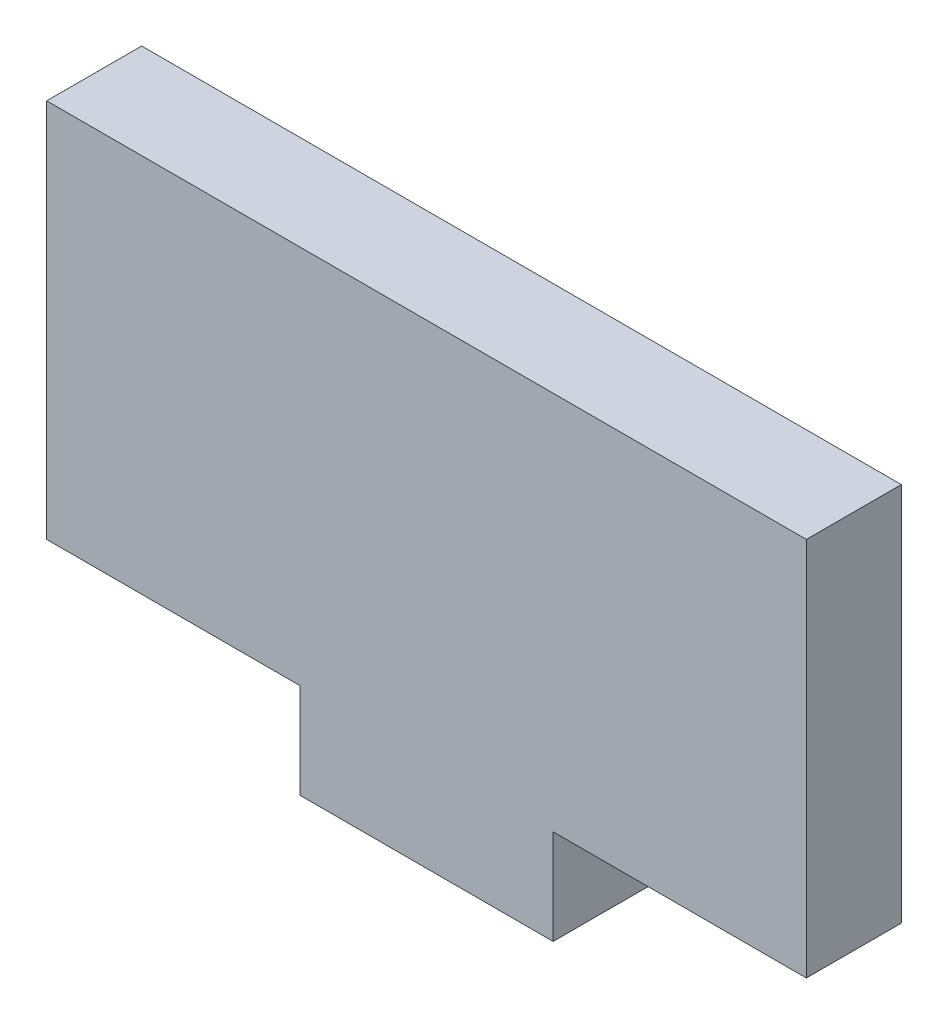
ISO-10303-21;
HEADER;
FILE_DESCRIPTION(('STEP AP214'),'2;1');
FILE_NAME('part.step','',(''),(''),'','','');
FILE_SCHEMA(('AUTOMOTIVE_DESIGN { 1 0 10303 214 1 1 1 1 }'));
ENDSEC;
DATA;
#1=APPLICATION_CONTEXT('core data for automotive mechanical design processes');
#2=APPLICATION_PROTOCOL_DEFINITION('international standard','automotive_design',2000,#1);
#3=PRODUCT_CONTEXT('',#1,'mechanical');
#4=PRODUCT('Part','Part','',(#3));
#5=PRODUCT_RELATED_PRODUCT_CATEGORY('part','',(#4));
#6=PRODUCT_DEFINITION_FORMATION('','',#4);
#7=PRODUCT_DEFINITION_CONTEXT('part definition',#1,'design');
#8=PRODUCT_DEFINITION('design','',#6,#7);
#9=PRODUCT_DEFINITION_SHAPE('','',#8);
#10=(LENGTH_UNIT() NAMED_UNIT(*) SI_UNIT(.MILLI.,.METRE.));
#11=(NAMED_UNIT(*) PLANE_ANGLE_UNIT() SI_UNIT($,.RADIAN.));
#12=(NAMED_UNIT(*) SI_UNIT($,.STERADIAN.) SOLID_ANGLE_UNIT());
#13=UNCERTAINTY_MEASURE_WITH_UNIT(LENGTH_MEASURE(1.E-05),#10,'distance_accuracy_value','');
#14=(GEOMETRIC_REPRESENTATION_CONTEXT(3) GLOBAL_UNCERTAINTY_ASSIGNED_CONTEXT((#13)) GLOBAL_UNIT_ASSIGNED_CONTEXT((#10,
#11,#12)) REPRESENTATION_CONTEXT('',''));
#15=CARTESIAN_POINT('',(0.,0.,0.));
#16=DIRECTION('',(0.,0.,1.));
#17=DIRECTION('',(1.,0.,0.));
#18=AXIS2_PLACEMENT_3D('',#15,#16,#17);
#19=CARTESIAN_POINT('',(0.,0.,6.35));
#20=DIRECTION('',(1.,0.,0.));
#21=DIRECTION('',(0.,0.,-1.));
#22=AXIS2_PLACEMENT_3D('',#19,#20,#21);
#23=PLANE('',#22);
#24=DIRECTION('',(0.,-1.,0.));
#25=VECTOR('',#24,1.);
#26=CARTESIAN_POINT('',(0.,0.,0.));
#27=LINE('',#26,#25);
#28=CARTESIAN_POINT('',(0.,25.4,0.));
#29=VERTEX_POINT('',#28);
#30=CARTESIAN_POINT('',(0.,0.,0.));
#31=VERTEX_POINT('',#30);
#32=EDGE_CURVE('E128',#29,#31,#27,.T.);
#33=ORIENTED_EDGE('',*,*,#32,.T.);
#34=DIRECTION('',(0.,0.,-1.));
#35=VECTOR('',#34,1.);
#36=CARTESIAN_POINT('',(0.,0.,6.35));
#37=LINE('',#36,#35);
#38=CARTESIAN_POINT('',(0.,0.,6.35));
#39=VERTEX_POINT('',#38);
#40=EDGE_CURVE('E11',#39,#31,#37,.T.);
#41=ORIENTED_EDGE('',*,*,#40,.F.);
#42=DIRECTION('',(0.,-1.,0.));
#43=VECTOR('',#42,1.);
#44=CARTESIAN_POINT('',(0.,0.,6.35));
#45=LINE('',#44,#43);
#46=CARTESIAN_POINT('',(0.,25.4,6.35));
#47=VERTEX_POINT('',#46);
#48=EDGE_CURVE('E142',#47,#39,#45,.T.);
#49=ORIENTED_EDGE('',*,*,#48,.F.);
#50=DIRECTION('',(0.,0.,-1.));
#51=VECTOR('',#50,1.);
#52=CARTESIAN_POINT('',(0.,25.4,6.35));
#53=LINE('',#52,#51);
#54=EDGE_CURVE('E124',#47,#29,#53,.T.);
#55=ORIENTED_EDGE('',*,*,#54,.T.);
#56=EDGE_LOOP('',(#33,#41,#49,#55));
#57=FACE_BOUND('',#56,.T.);
#58=ADVANCED_FACE('F32',(#57),#23,.F.);
#59=CARTESIAN_POINT('',(0.,0.,6.35));
#60=DIRECTION('',(0.,1.,0.));
#61=DIRECTION('',(0.,0.,1.));
#62=AXIS2_PLACEMENT_3D('',#59,#60,#61);
#63=PLANE('',#62);
#64=DIRECTION('',(1.,0.,0.));
#65=VECTOR('',#64,1.);
#66=CARTESIAN_POINT('',(0.,0.,0.));
#67=LINE('',#66,#65);
#68=CARTESIAN_POINT('',(16.9333333333333,0.,0.));
#69=VERTEX_POINT('',#68);
#70=EDGE_CURVE('E131',#31,#69,#67,.T.);
#71=ORIENTED_EDGE('',*,*,#70,.T.);
#72=DIRECTION('',(0.,0.,-1.));
#73=VECTOR('',#72,1.);
#74=CARTESIAN_POINT('',(16.9333333333333,0.,6.35));
#75=LINE('',#74,#73);
#76=CARTESIAN_POINT('',(16.9333333333333,0.,6.35));
#77=VERTEX_POINT('',#76);
#78=EDGE_CURVE('E40',#77,#69,#75,.T.);
#79=ORIENTED_EDGE('',*,*,#78,.F.);
#80=DIRECTION('',(1.,0.,0.));
#81=VECTOR('',#80,1.);
#82=CARTESIAN_POINT('',(0.,0.,6.35));
#83=LINE('',#82,#81);
#84=EDGE_CURVE('E91',#39,#77,#83,.T.);
#85=ORIENTED_EDGE('',*,*,#84,.F.);
#86=ORIENTED_EDGE('',*,*,#40,.T.);
#87=EDGE_LOOP('',(#71,#79,#85,#86));
#88=FACE_BOUND('',#87,.T.);
#89=ADVANCED_FACE('F177',(#88),#63,.F.);
#90=CARTESIAN_POINT('',(16.9333333333333,0.,6.35));
#91=DIRECTION('',(1.,0.,0.));
#92=DIRECTION('',(0.,1.,0.));
#93=AXIS2_PLACEMENT_3D('',#90,#91,#92);
#94=PLANE('',#93);
#95=DIRECTION('',(0.,-1.,0.));
#96=VECTOR('',#95,1.);
#97=CARTESIAN_POINT('',(16.9333333333333,0.,0.));
#98=LINE('',#97,#96);
#99=CARTESIAN_POINT('',(16.9333333333333,-6.35,0.));
#100=VERTEX_POINT('',#99);
#101=EDGE_CURVE('E133',#69,#100,#98,.T.);
#102=ORIENTED_EDGE('',*,*,#101,.T.);
#103=DIRECTION('',(0.,0.,-1.));
#104=VECTOR('',#103,1.);
#105=CARTESIAN_POINT('',(16.9333333333333,-6.35,6.35));
#106=LINE('',#105,#104);
#107=CARTESIAN_POINT('',(16.9333333333333,-6.35,6.35));
#108=VERTEX_POINT('',#107);
#109=EDGE_CURVE('E149',#108,#100,#106,.T.);
#110=ORIENTED_EDGE('',*,*,#109,.F.);
#111=DIRECTION('',(0.,-1.,0.));
#112=VECTOR('',#111,1.);
#113=CARTESIAN_POINT('',(16.9333333333333,0.,6.35));
#114=LINE('',#113,#112);
#115=EDGE_CURVE('E157',#77,#108,#114,.T.);
#116=ORIENTED_EDGE('',*,*,#115,.F.);
#117=ORIENTED_EDGE('',*,*,#78,.T.);
#118=EDGE_LOOP('',(#102,#110,#116,#117));
#119=FACE_BOUND('',#118,.T.);
#120=ADVANCED_FACE('F155',(#119),#94,.F.);
#121=CARTESIAN_POINT('',(16.9333333333333,-6.35,6.35));
#122=DIRECTION('',(0.,1.,0.));
#123=DIRECTION('',(0.,0.,1.));
#124=AXIS2_PLACEMENT_3D('',#121,#122,#123);
#125=PLANE('',#124);
#126=DIRECTION('',(1.,0.,0.));
#127=VECTOR('',#126,1.);
#128=CARTESIAN_POINT('',(16.9333333333333,-6.35,0.));
#129=LINE('',#128,#127);
#130=CARTESIAN_POINT('',(33.8666666666667,-6.35,0.));
#131=VERTEX_POINT('',#130);
#132=EDGE_CURVE('E135',#100,#131,#129,.T.);
#133=ORIENTED_EDGE('',*,*,#132,.T.);
#134=DIRECTION('',(0.,0.,-1.));
#135=VECTOR('',#134,1.);
#136=CARTESIAN_POINT('',(33.8666666666667,-6.35,6.35));
#137=LINE('',#136,#135);
#138=CARTESIAN_POINT('',(33.8666666666667,-6.35,6.35));
#139=VERTEX_POINT('',#138);
#140=EDGE_CURVE('E146',#139,#131,#137,.T.);
#141=ORIENTED_EDGE('',*,*,#140,.F.);
#142=DIRECTION('',(1.,0.,0.));
#143=VECTOR('',#142,1.);
#144=CARTESIAN_POINT('',(16.9333333333333,-6.35,6.35));
#145=LINE('',#144,#143);
#146=EDGE_CURVE('E169',#108,#139,#145,.T.);
#147=ORIENTED_EDGE('',*,*,#146,.F.);
#148=ORIENTED_EDGE('',*,*,#109,.T.);
#149=EDGE_LOOP('',(#133,#141,#147,#148));
#150=FACE_BOUND('',#149,.T.);
#151=ADVANCED_FACE('F165',(#150),#125,.F.);
#152=CARTESIAN_POINT('',(33.8666666666667,0.,6.35));
#153=DIRECTION('',(-1.,0.,0.));
#154=DIRECTION('',(0.,-1.,0.));
#155=AXIS2_PLACEMENT_3D('',#152,#153,#154);
#156=PLANE('',#155);
#157=DIRECTION('',(0.,1.,0.));
#158=VECTOR('',#157,1.);
#159=CARTESIAN_POINT('',(33.8666666666667,0.,0.));
#160=LINE('',#159,#158);
#161=CARTESIAN_POINT('',(33.8666666666667,0.,0.));
#162=VERTEX_POINT('',#161);
#163=EDGE_CURVE('E137',#131,#162,#160,.T.);
#164=ORIENTED_EDGE('',*,*,#163,.T.);
#165=DIRECTION('',(0.,0.,-1.));
#166=VECTOR('',#165,1.);
#167=CARTESIAN_POINT('',(33.8666666666667,0.,6.35));
#168=LINE('',#167,#166);
#169=CARTESIAN_POINT('',(33.8666666666667,0.,6.35));
#170=VERTEX_POINT('',#169);
#171=EDGE_CURVE('E119',#170,#162,#168,.T.);
#172=ORIENTED_EDGE('',*,*,#171,.F.);
#173=DIRECTION('',(0.,1.,0.));
#174=VECTOR('',#173,1.);
#175=CARTESIAN_POINT('',(33.8666666666667,0.,6.35));
#176=LINE('',#175,#174);
#177=EDGE_CURVE('E110',#139,#170,#176,.T.);
#178=ORIENTED_EDGE('',*,*,#177,.F.);
#179=ORIENTED_EDGE('',*,*,#140,.T.);
#180=EDGE_LOOP('',(#164,#172,#178,#179));
#181=FACE_BOUND('',#180,.T.);
#182=ADVANCED_FACE('F168',(#181),#156,.F.);
#183=CARTESIAN_POINT('',(33.8666666666667,0.,6.35));
#184=DIRECTION('',(0.,1.,0.));
#185=DIRECTION('',(0.,0.,1.));
#186=AXIS2_PLACEMENT_3D('',#183,#184,#185);
#187=PLANE('',#186);
#188=DIRECTION('',(1.,0.,0.));
#189=VECTOR('',#188,1.);
#190=CARTESIAN_POINT('',(33.8666666666667,0.,0.));
#191=LINE('',#190,#189);
#192=CARTESIAN_POINT('',(50.8,0.,0.));
#193=VERTEX_POINT('',#192);
#194=EDGE_CURVE('E118',#162,#193,#191,.T.);
#195=ORIENTED_EDGE('',*,*,#194,.T.);
#196=DIRECTION('',(0.,0.,-1.));
#197=VECTOR('',#196,1.);
#198=CARTESIAN_POINT('',(50.8,0.,6.35));
#199=LINE('',#198,#197);
#200=CARTESIAN_POINT('',(50.8,0.,6.35));
#201=VERTEX_POINT('',#200);
#202=EDGE_CURVE('E115',#201,#193,#199,.T.);
#203=ORIENTED_EDGE('',*,*,#202,.F.);
#204=DIRECTION('',(1.,0.,0.));
#205=VECTOR('',#204,1.);
#206=CARTESIAN_POINT('',(33.8666666666667,0.,6.35));
#207=LINE('',#206,#205);
#208=EDGE_CURVE('E104',#170,#201,#207,.T.);
#209=ORIENTED_EDGE('',*,*,#208,.F.);
#210=ORIENTED_EDGE('',*,*,#171,.T.);
#211=EDGE_LOOP('',(#195,#203,#209,#210));
#212=FACE_BOUND('',#211,.T.);
#213=ADVANCED_FACE('F116',(#212),#187,.F.);
#214=CARTESIAN_POINT('',(50.8,0.,6.35));
#215=DIRECTION('',(-1.,0.,0.));
#216=DIRECTION('',(0.,0.,1.));
#217=AXIS2_PLACEMENT_3D('',#214,#215,#216);
#218=PLANE('',#217);
#219=DIRECTION('',(0.,1.,0.));
#220=VECTOR('',#219,1.);
#221=CARTESIAN_POINT('',(50.8,0.,0.));
#222=LINE('',#221,#220);
#223=CARTESIAN_POINT('',(50.8,25.4,0.));
#224=VERTEX_POINT('',#223);
#225=EDGE_CURVE('E77',#193,#224,#222,.T.);
#226=ORIENTED_EDGE('',*,*,#225,.T.);
#227=DIRECTION('',(0.,0.,-1.));
#228=VECTOR('',#227,1.);
#229=CARTESIAN_POINT('',(50.8,25.4,6.35));
#230=LINE('',#229,#228);
#231=CARTESIAN_POINT('',(50.8,25.4,6.35));
#232=VERTEX_POINT('',#231);
#233=EDGE_CURVE('E120',#232,#224,#230,.T.);
#234=ORIENTED_EDGE('',*,*,#233,.F.);
#235=DIRECTION('',(0.,1.,0.));
#236=VECTOR('',#235,1.);
#237=CARTESIAN_POINT('',(50.8,0.,6.35));
#238=LINE('',#237,#236);
#239=EDGE_CURVE('E108',#201,#232,#238,.T.);
#240=ORIENTED_EDGE('',*,*,#239,.F.);
#241=ORIENTED_EDGE('',*,*,#202,.T.);
#242=EDGE_LOOP('',(#226,#234,#240,#241));
#243=FACE_BOUND('',#242,.T.);
#244=ADVANCED_FACE('F122',(#243),#218,.F.);
#245=CARTESIAN_POINT('',(0.,25.4,6.35));
#246=DIRECTION('',(0.,-1.,0.));
#247=DIRECTION('',(0.,0.,-1.));
#248=AXIS2_PLACEMENT_3D('',#245,#246,#247);
#249=PLANE('',#248);
#250=DIRECTION('',(-1.,0.,0.));
#251=VECTOR('',#250,1.);
#252=CARTESIAN_POINT('',(0.,25.4,0.));
#253=LINE('',#252,#251);
#254=EDGE_CURVE('E83',#224,#29,#253,.T.);
#255=ORIENTED_EDGE('',*,*,#254,.T.);
#256=ORIENTED_EDGE('',*,*,#54,.F.);
#257=DIRECTION('',(-1.,0.,0.));
#258=VECTOR('',#257,1.);
#259=CARTESIAN_POINT('',(0.,25.4,6.35));
#260=LINE('',#259,#258);
#261=EDGE_CURVE('E48',#232,#47,#260,.T.);
#262=ORIENTED_EDGE('',*,*,#261,.F.);
#263=ORIENTED_EDGE('',*,*,#233,.T.);
#264=EDGE_LOOP('',(#255,#256,#262,#263));
#265=FACE_BOUND('',#264,.T.);
#266=ADVANCED_FACE('F193',(#265),#249,.F.);
#267=CARTESIAN_POINT('',(0.,0.,6.35));
#268=DIRECTION('',(0.,0.,-1.));
#269=DIRECTION('',(-1.,0.,0.));
#270=AXIS2_PLACEMENT_3D('',#267,#268,#269);
#271=PLANE('',#270);
#272=ORIENTED_EDGE('',*,*,#48,.T.);
#273=ORIENTED_EDGE('',*,*,#84,.T.);
#274=ORIENTED_EDGE('',*,*,#115,.T.);
#275=ORIENTED_EDGE('',*,*,#146,.T.);
#276=ORIENTED_EDGE('',*,*,#177,.T.);
#277=ORIENTED_EDGE('',*,*,#208,.T.);
#278=ORIENTED_EDGE('',*,*,#239,.T.);
#279=ORIENTED_EDGE('',*,*,#261,.T.);
#280=EDGE_LOOP('',(#272,#273,#274,#275,#276,#277,#278,#279));
#281=FACE_BOUND('',#280,.T.);
#282=ADVANCED_FACE('F106',(#281),#271,.F.);
#283=CARTESIAN_POINT('',(0.,0.,0.));
#284=DIRECTION('',(0.,0.,-1.));
#285=DIRECTION('',(-1.,0.,0.));
#286=AXIS2_PLACEMENT_3D('',#283,#284,#285);
#287=PLANE('',#286);
#288=ORIENTED_EDGE('',*,*,#32,.F.);
#289=ORIENTED_EDGE('',*,*,#254,.F.);
#290=ORIENTED_EDGE('',*,*,#225,.F.);
#291=ORIENTED_EDGE('',*,*,#194,.F.);
#292=ORIENTED_EDGE('',*,*,#163,.F.);
#293=ORIENTED_EDGE('',*,*,#132,.F.);
#294=ORIENTED_EDGE('',*,*,#101,.F.);
#295=ORIENTED_EDGE('',*,*,#70,.F.);
#296=EDGE_LOOP('',(#288,#289,#290,#291,#292,#293,#294,#295));
#297=FACE_BOUND('',#296,.T.);
#298=ADVANCED_FACE('F161',(#297),#287,.T.);
#299=CLOSED_SHELL('',(#58,#89,#120,#151,#182,#213,#244,#266,#282,#298));
#300=MANIFOLD_SOLID_BREP('B2',#299);
#301=ADVANCED_BREP_SHAPE_REPRESENTATION('',(#18,#300),#14);
#302=SHAPE_DEFINITION_REPRESENTATION(#9,#301);
ENDSEC;
END-ISO-10303-21;
